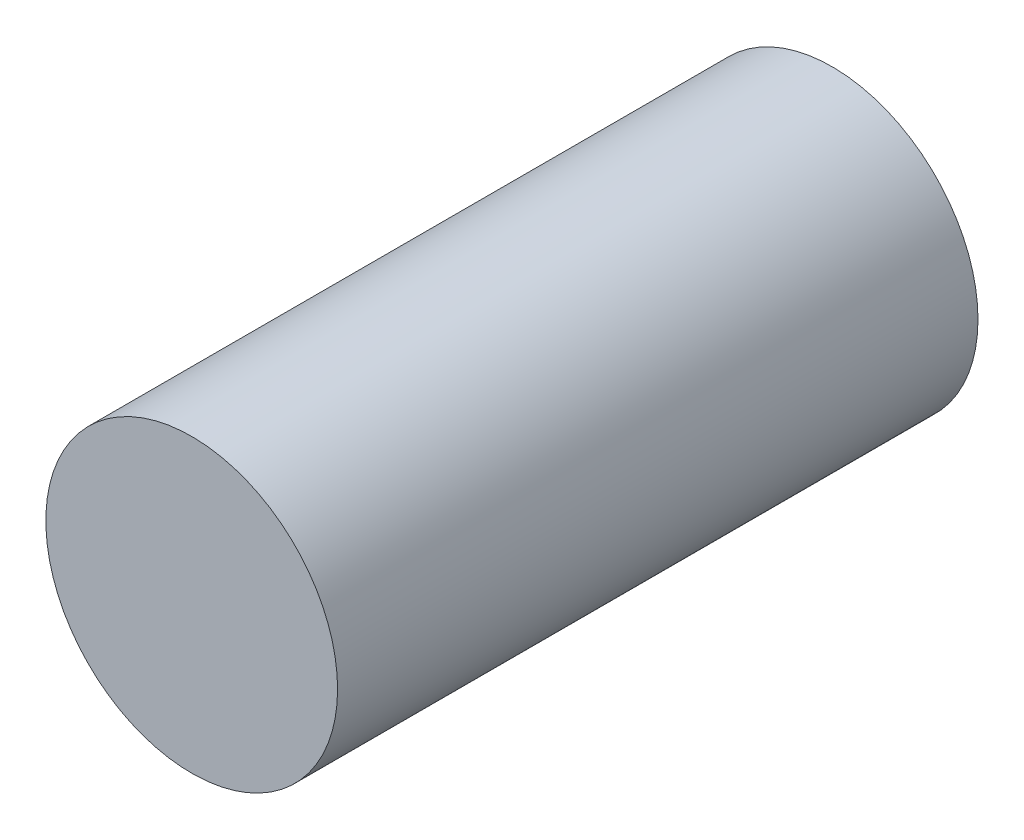
ISO-10303-21;
HEADER;
FILE_DESCRIPTION(('STEP AP214'),'2;1');
FILE_NAME('part.step','',(''),(''),'','','');
FILE_SCHEMA(('AUTOMOTIVE_DESIGN { 1 0 10303 214 1 1 1 1 }'));
ENDSEC;
DATA;
#1=APPLICATION_CONTEXT('core data for automotive mechanical design processes');
#2=APPLICATION_PROTOCOL_DEFINITION('international standard','automotive_design',2000,#1);
#3=PRODUCT_CONTEXT('',#1,'mechanical');
#4=PRODUCT('Part','Part','',(#3));
#5=PRODUCT_RELATED_PRODUCT_CATEGORY('part','',(#4));
#6=PRODUCT_DEFINITION_FORMATION('','',#4);
#7=PRODUCT_DEFINITION_CONTEXT('part definition',#1,'design');
#8=PRODUCT_DEFINITION('design','',#6,#7);
#9=PRODUCT_DEFINITION_SHAPE('','',#8);
#10=(LENGTH_UNIT() NAMED_UNIT(*) SI_UNIT(.MILLI.,.METRE.));
#11=(NAMED_UNIT(*) PLANE_ANGLE_UNIT() SI_UNIT($,.RADIAN.));
#12=(NAMED_UNIT(*) SI_UNIT($,.STERADIAN.) SOLID_ANGLE_UNIT());
#13=UNCERTAINTY_MEASURE_WITH_UNIT(LENGTH_MEASURE(1.E-05),#10,'distance_accuracy_value','');
#14=(GEOMETRIC_REPRESENTATION_CONTEXT(3) GLOBAL_UNCERTAINTY_ASSIGNED_CONTEXT((#13)) GLOBAL_UNIT_ASSIGNED_CONTEXT((#10,
#11,#12)) REPRESENTATION_CONTEXT('',''));
#15=CARTESIAN_POINT('',(0.,0.,0.));
#16=DIRECTION('',(0.,0.,1.));
#17=DIRECTION('',(1.,0.,0.));
#18=AXIS2_PLACEMENT_3D('',#15,#16,#17);
#19=CARTESIAN_POINT('',(2.54,-1.27,0.1));
#20=DIRECTION('',(0.,0.,1.));
#21=DIRECTION('',(1.,0.,0.));
#22=AXIS2_PLACEMENT_3D('',#19,#20,#21);
#23=PLANE('',#22);
#24=CARTESIAN_POINT('',(2.54,-1.27,0.1));
#25=DIRECTION('',(0.,0.,1.));
#26=DIRECTION('',(1.,0.,0.));
#27=AXIS2_PLACEMENT_3D('',#24,#25,#26);
#28=CIRCLE('',#27,0.41);
#29=CARTESIAN_POINT('',(2.95,-1.27,0.1));
#30=VERTEX_POINT('',#29);
#31=EDGE_CURVE('E17',#30,#30,#28,.F.);
#32=ORIENTED_EDGE('',*,*,#31,.F.);
#33=EDGE_LOOP('',(#32));
#34=FACE_BOUND('',#33,.T.);
#35=ADVANCED_FACE('F14',(#34),#23,.T.);
#36=CARTESIAN_POINT('',(2.54,-1.27,-1.7));
#37=DIRECTION('',(0.,0.,1.));
#38=DIRECTION('',(1.,0.,0.));
#39=AXIS2_PLACEMENT_3D('',#36,#37,#38);
#40=PLANE('',#39);
#41=CARTESIAN_POINT('',(2.54,-1.27,-1.7));
#42=DIRECTION('',(0.,0.,1.));
#43=DIRECTION('',(1.,0.,0.));
#44=AXIS2_PLACEMENT_3D('',#41,#42,#43);
#45=CIRCLE('',#44,0.41);
#46=CARTESIAN_POINT('',(2.95,-1.27,-1.7));
#47=VERTEX_POINT('',#46);
#48=EDGE_CURVE('E10',#47,#47,#45,.T.);
#49=ORIENTED_EDGE('',*,*,#48,.F.);
#50=EDGE_LOOP('',(#49));
#51=FACE_BOUND('',#50,.T.);
#52=ADVANCED_FACE('F29',(#51),#40,.F.);
#53=CARTESIAN_POINT('',(2.54,-1.27,-1.7));
#54=DIRECTION('',(0.,0.,1.));
#55=DIRECTION('',(1.,0.,0.));
#56=AXIS2_PLACEMENT_3D('',#53,#54,#55);
#57=CYLINDRICAL_SURFACE('',#56,0.41);
#58=ORIENTED_EDGE('',*,*,#48,.T.);
#59=EDGE_LOOP('',(#58));
#60=FACE_BOUND('',#59,.T.);
#61=ORIENTED_EDGE('',*,*,#31,.T.);
#62=EDGE_LOOP('',(#61));
#63=FACE_BOUND('',#62,.T.);
#64=ADVANCED_FACE('F26',(#60,#63),#57,.T.);
#65=CLOSED_SHELL('',(#35,#52,#64));
#66=MANIFOLD_SOLID_BREP('B1',#65);
#67=ADVANCED_BREP_SHAPE_REPRESENTATION('',(#18,#66),#14);
#68=SHAPE_DEFINITION_REPRESENTATION(#9,#67);
ENDSEC;
END-ISO-10303-21;
